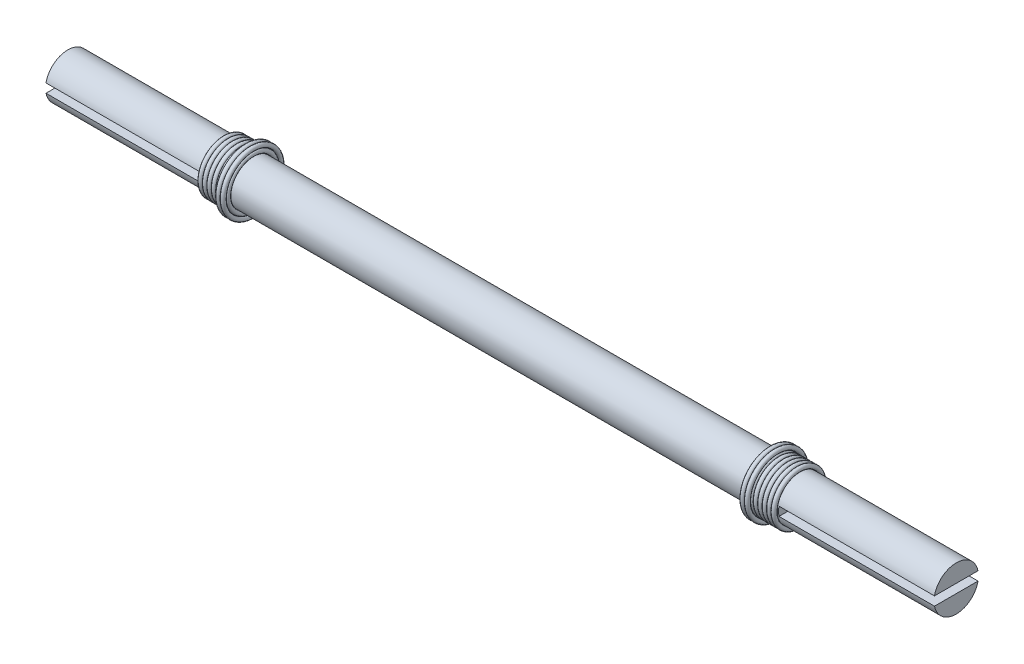
ISO-10303-21;
HEADER;
FILE_DESCRIPTION(('STEP AP214'),'2;1');
FILE_NAME('part.step','',(''),(''),'','','');
FILE_SCHEMA(('AUTOMOTIVE_DESIGN { 1 0 10303 214 1 1 1 1 }'));
ENDSEC;
DATA;
#1=APPLICATION_CONTEXT('core data for automotive mechanical design processes');
#2=APPLICATION_PROTOCOL_DEFINITION('international standard','automotive_design',2000,#1);
#3=PRODUCT_CONTEXT('',#1,'mechanical');
#4=PRODUCT('Part','Part','',(#3));
#5=PRODUCT_RELATED_PRODUCT_CATEGORY('part','',(#4));
#6=PRODUCT_DEFINITION_FORMATION('','',#4);
#7=PRODUCT_DEFINITION_CONTEXT('part definition',#1,'design');
#8=PRODUCT_DEFINITION('design','',#6,#7);
#9=PRODUCT_DEFINITION_SHAPE('','',#8);
#10=(LENGTH_UNIT() NAMED_UNIT(*) SI_UNIT(.MILLI.,.METRE.));
#11=(NAMED_UNIT(*) PLANE_ANGLE_UNIT() SI_UNIT($,.RADIAN.));
#12=(NAMED_UNIT(*) SI_UNIT($,.STERADIAN.) SOLID_ANGLE_UNIT());
#13=UNCERTAINTY_MEASURE_WITH_UNIT(LENGTH_MEASURE(1.E-05),#10,'distance_accuracy_value','');
#14=(GEOMETRIC_REPRESENTATION_CONTEXT(3) GLOBAL_UNCERTAINTY_ASSIGNED_CONTEXT((#13)) GLOBAL_UNIT_ASSIGNED_CONTEXT((#10,
#11,#12)) REPRESENTATION_CONTEXT('',''));
#15=CARTESIAN_POINT('',(0.,0.,0.));
#16=DIRECTION('',(0.,0.,1.));
#17=DIRECTION('',(1.,0.,0.));
#18=AXIS2_PLACEMENT_3D('',#15,#16,#17);
#19=CARTESIAN_POINT('',(100.,0.,0.));
#20=DIRECTION('',(1.,0.,0.));
#21=DIRECTION('',(0.,0.,-1.));
#22=AXIS2_PLACEMENT_3D('',#19,#20,#21);
#23=PLANE('',#22);
#24=DIRECTION('',(0.,0.,1.));
#25=VECTOR('',#24,1.);
#26=CARTESIAN_POINT('',(100.,1.,0.));
#27=LINE('',#26,#25);
#28=CARTESIAN_POINT('',(100.,1.,-4.89897948556633));
#29=VERTEX_POINT('',#28);
#30=CARTESIAN_POINT('',(100.,1.,4.89897948556636));
#31=VERTEX_POINT('',#30);
#32=EDGE_CURVE('E183',#29,#31,#27,.T.);
#33=ORIENTED_EDGE('',*,*,#32,.F.);
#34=CARTESIAN_POINT('',(100.,0.,0.));
#35=DIRECTION('',(1.,0.,0.));
#36=DIRECTION('',(0.,0.,-1.));
#37=AXIS2_PLACEMENT_3D('',#34,#35,#36);
#38=CIRCLE('',#37,5.);
#39=EDGE_CURVE('E179',#29,#31,#38,.T.);
#40=ORIENTED_EDGE('',*,*,#39,.T.);
#41=EDGE_LOOP('',(#33,#40));
#42=FACE_BOUND('',#41,.T.);
#43=ADVANCED_FACE('F64',(#42),#23,.T.);
#44=CARTESIAN_POINT('',(100.,0.,0.));
#45=DIRECTION('',(-1.,0.,0.));
#46=DIRECTION('',(0.,0.,1.));
#47=AXIS2_PLACEMENT_3D('',#44,#45,#46);
#48=CYLINDRICAL_SURFACE('',#47,5.);
#49=ORIENTED_EDGE('',*,*,#39,.F.);
#50=DIRECTION('',(-1.,0.,0.));
#51=VECTOR('',#50,1.);
#52=CARTESIAN_POINT('',(100.,1.,-4.89897948556633));
#53=LINE('',#52,#51);
#54=CARTESIAN_POINT('',(65.,1.,-4.89897948556633));
#55=VERTEX_POINT('',#54);
#56=EDGE_CURVE('E175',#29,#55,#53,.T.);
#57=ORIENTED_EDGE('',*,*,#56,.T.);
#58=CARTESIAN_POINT('',(65.,0.,0.));
#59=DIRECTION('',(-1.,0.,0.));
#60=DIRECTION('',(0.,0.,1.));
#61=AXIS2_PLACEMENT_3D('',#58,#59,#60);
#62=CIRCLE('',#61,5.);
#63=CARTESIAN_POINT('',(65.,-1.,-4.89897948556636));
#64=VERTEX_POINT('',#63);
#65=EDGE_CURVE('E14',#55,#64,#62,.T.);
#66=ORIENTED_EDGE('',*,*,#65,.T.);
#67=DIRECTION('',(-1.,0.,0.));
#68=VECTOR('',#67,1.);
#69=CARTESIAN_POINT('',(100.,-1.,-4.89897948556636));
#70=LINE('',#69,#68);
#71=CARTESIAN_POINT('',(100.,-1.,-4.89897948556636));
#72=VERTEX_POINT('',#71);
#73=EDGE_CURVE('E170',#64,#72,#70,.F.);
#74=ORIENTED_EDGE('',*,*,#73,.T.);
#75=CARTESIAN_POINT('',(100.,-1.,4.89897948556636));
#76=VERTEX_POINT('',#75);
#77=EDGE_CURVE('E178',#76,#72,#38,.T.);
#78=ORIENTED_EDGE('',*,*,#77,.F.);
#79=DIRECTION('',(-1.,0.,0.));
#80=VECTOR('',#79,1.);
#81=CARTESIAN_POINT('',(100.,-1.,4.89897948556636));
#82=LINE('',#81,#80);
#83=CARTESIAN_POINT('',(65.,-1.,4.89897948556636));
#84=VERTEX_POINT('',#83);
#85=EDGE_CURVE('E79',#76,#84,#82,.T.);
#86=ORIENTED_EDGE('',*,*,#85,.T.);
#87=CARTESIAN_POINT('',(65.,1.,4.89897948556636));
#88=VERTEX_POINT('',#87);
#89=EDGE_CURVE('E68',#84,#88,#62,.T.);
#90=ORIENTED_EDGE('',*,*,#89,.T.);
#91=DIRECTION('',(-1.,0.,0.));
#92=VECTOR('',#91,1.);
#93=CARTESIAN_POINT('',(100.,1.,4.89897948556636));
#94=LINE('',#93,#92);
#95=EDGE_CURVE('E87',#88,#31,#94,.F.);
#96=ORIENTED_EDGE('',*,*,#95,.T.);
#97=EDGE_LOOP('',(#49,#57,#66,#74,#78,#86,#90,#96));
#98=FACE_BOUND('',#97,.T.);
#99=CARTESIAN_POINT('',(-100.,0.,0.));
#100=DIRECTION('',(1.,0.,0.));
#101=DIRECTION('',(0.,0.,-1.));
#102=AXIS2_PLACEMENT_3D('',#99,#100,#101);
#103=CIRCLE('',#102,5.);
#104=CARTESIAN_POINT('',(-100.,1.,-4.89897948556633));
#105=VERTEX_POINT('',#104);
#106=CARTESIAN_POINT('',(-100.,1.,4.89897948556636));
#107=VERTEX_POINT('',#106);
#108=EDGE_CURVE('E139',#105,#107,#103,.T.);
#109=ORIENTED_EDGE('',*,*,#108,.T.);
#110=DIRECTION('',(1.,0.,0.));
#111=VECTOR('',#110,1.);
#112=CARTESIAN_POINT('',(-100.,1.,4.89897948556636));
#113=LINE('',#112,#111);
#114=CARTESIAN_POINT('',(-65.,1.,4.89897948556636));
#115=VERTEX_POINT('',#114);
#116=EDGE_CURVE('E155',#115,#107,#113,.F.);
#117=ORIENTED_EDGE('',*,*,#116,.F.);
#118=CARTESIAN_POINT('',(-65.,0.,0.));
#119=DIRECTION('',(-1.,0.,0.));
#120=DIRECTION('',(0.,0.,1.));
#121=AXIS2_PLACEMENT_3D('',#118,#119,#120);
#122=CIRCLE('',#121,5.);
#123=CARTESIAN_POINT('',(-65.,-1.,4.89897948556636));
#124=VERTEX_POINT('',#123);
#125=EDGE_CURVE('E161',#124,#115,#122,.T.);
#126=ORIENTED_EDGE('',*,*,#125,.F.);
#127=DIRECTION('',(1.,0.,0.));
#128=VECTOR('',#127,1.);
#129=CARTESIAN_POINT('',(-100.,-1.,4.89897948556636));
#130=LINE('',#129,#128);
#131=CARTESIAN_POINT('',(-100.,-1.,4.89897948556636));
#132=VERTEX_POINT('',#131);
#133=EDGE_CURVE('E148',#132,#124,#130,.T.);
#134=ORIENTED_EDGE('',*,*,#133,.F.);
#135=CARTESIAN_POINT('',(-100.,-1.,-4.89897948556636));
#136=VERTEX_POINT('',#135);
#137=EDGE_CURVE('E134',#132,#136,#103,.T.);
#138=ORIENTED_EDGE('',*,*,#137,.T.);
#139=DIRECTION('',(1.,0.,0.));
#140=VECTOR('',#139,1.);
#141=CARTESIAN_POINT('',(-100.,-1.,-4.89897948556636));
#142=LINE('',#141,#140);
#143=CARTESIAN_POINT('',(-65.,-1.,-4.89897948556636));
#144=VERTEX_POINT('',#143);
#145=EDGE_CURVE('E142',#144,#136,#142,.F.);
#146=ORIENTED_EDGE('',*,*,#145,.F.);
#147=CARTESIAN_POINT('',(-65.,1.,-4.89897948556633));
#148=VERTEX_POINT('',#147);
#149=EDGE_CURVE('E164',#148,#144,#122,.T.);
#150=ORIENTED_EDGE('',*,*,#149,.F.);
#151=DIRECTION('',(1.,0.,0.));
#152=VECTOR('',#151,1.);
#153=CARTESIAN_POINT('',(-100.,1.,-4.89897948556633));
#154=LINE('',#153,#152);
#155=EDGE_CURVE('E152',#105,#148,#154,.T.);
#156=ORIENTED_EDGE('',*,*,#155,.F.);
#157=EDGE_LOOP('',(#109,#117,#126,#134,#138,#146,#150,#156));
#158=FACE_BOUND('',#157,.T.);
#159=ADVANCED_FACE('F66',(#98,#158),#48,.T.);
#160=DIRECTION('',(0.,0.,-1.));
#161=VECTOR('',#160,1.);
#162=CARTESIAN_POINT('',(100.,-1.,0.));
#163=LINE('',#162,#161);
#164=EDGE_CURVE('E182',#76,#72,#163,.T.);
#165=ORIENTED_EDGE('',*,*,#164,.F.);
#166=ORIENTED_EDGE('',*,*,#77,.T.);
#167=EDGE_LOOP('',(#165,#166));
#168=FACE_BOUND('',#167,.T.);
#169=ADVANCED_FACE('F194',(#168),#23,.T.);
#170=CARTESIAN_POINT('',(65.,0.,0.));
#171=DIRECTION('',(-1.,0.,0.));
#172=DIRECTION('',(0.,0.,1.));
#173=AXIS2_PLACEMENT_3D('',#170,#171,#172);
#174=PLANE('',#173);
#175=DIRECTION('',(0.,0.,1.));
#176=VECTOR('',#175,1.);
#177=CARTESIAN_POINT('',(65.,1.,6.45567951505827));
#178=LINE('',#177,#176);
#179=EDGE_CURVE('E165',#55,#88,#178,.T.);
#180=ORIENTED_EDGE('',*,*,#179,.T.);
#181=ORIENTED_EDGE('',*,*,#89,.F.);
#182=DIRECTION('',(0.,0.,-1.));
#183=VECTOR('',#182,1.);
#184=CARTESIAN_POINT('',(65.,-1.,-7.22510667641652));
#185=LINE('',#184,#183);
#186=EDGE_CURVE('E167',#84,#64,#185,.T.);
#187=ORIENTED_EDGE('',*,*,#186,.T.);
#188=ORIENTED_EDGE('',*,*,#65,.F.);
#189=EDGE_LOOP('',(#180,#181,#187,#188));
#190=FACE_BOUND('',#189,.T.);
#191=ADVANCED_FACE('F190',(#190),#174,.F.);
#192=CARTESIAN_POINT('',(65.,1.,0.));
#193=DIRECTION('',(0.,1.,0.));
#194=DIRECTION('',(0.,0.,1.));
#195=AXIS2_PLACEMENT_3D('',#192,#193,#194);
#196=PLANE('',#195);
#197=ORIENTED_EDGE('',*,*,#32,.T.);
#198=ORIENTED_EDGE('',*,*,#95,.F.);
#199=ORIENTED_EDGE('',*,*,#179,.F.);
#200=ORIENTED_EDGE('',*,*,#56,.F.);
#201=EDGE_LOOP('',(#197,#198,#199,#200));
#202=FACE_BOUND('',#201,.T.);
#203=ADVANCED_FACE('F200',(#202),#196,.F.);
#204=CARTESIAN_POINT('',(65.,-1.,-7.22510667641652));
#205=DIRECTION('',(0.,-1.,0.));
#206=DIRECTION('',(0.,0.,-1.));
#207=AXIS2_PLACEMENT_3D('',#204,#205,#206);
#208=PLANE('',#207);
#209=ORIENTED_EDGE('',*,*,#164,.T.);
#210=ORIENTED_EDGE('',*,*,#73,.F.);
#211=ORIENTED_EDGE('',*,*,#186,.F.);
#212=ORIENTED_EDGE('',*,*,#85,.F.);
#213=EDGE_LOOP('',(#209,#210,#211,#212));
#214=FACE_BOUND('',#213,.T.);
#215=ADVANCED_FACE('F191',(#214),#208,.F.);
#216=CARTESIAN_POINT('',(-100.,0.,0.));
#217=DIRECTION('',(-1.,0.,0.));
#218=DIRECTION('',(0.,0.,-1.));
#219=AXIS2_PLACEMENT_3D('',#216,#217,#218);
#220=PLANE('',#219);
#221=DIRECTION('',(0.,0.,1.));
#222=VECTOR('',#221,1.);
#223=CARTESIAN_POINT('',(-100.,1.,0.));
#224=LINE('',#223,#222);
#225=EDGE_CURVE('E138',#105,#107,#224,.T.);
#226=ORIENTED_EDGE('',*,*,#225,.T.);
#227=ORIENTED_EDGE('',*,*,#108,.F.);
#228=EDGE_LOOP('',(#226,#227));
#229=FACE_BOUND('',#228,.T.);
#230=ADVANCED_FACE('F212',(#229),#220,.T.);
#231=DIRECTION('',(0.,0.,-1.));
#232=VECTOR('',#231,1.);
#233=CARTESIAN_POINT('',(-100.,-1.,0.));
#234=LINE('',#233,#232);
#235=EDGE_CURVE('E130',#132,#136,#234,.T.);
#236=ORIENTED_EDGE('',*,*,#235,.T.);
#237=ORIENTED_EDGE('',*,*,#137,.F.);
#238=EDGE_LOOP('',(#236,#237));
#239=FACE_BOUND('',#238,.T.);
#240=ADVANCED_FACE('F132',(#239),#220,.T.);
#241=CARTESIAN_POINT('',(-65.,0.,0.));
#242=DIRECTION('',(1.,0.,0.));
#243=DIRECTION('',(0.,0.,1.));
#244=AXIS2_PLACEMENT_3D('',#241,#242,#243);
#245=PLANE('',#244);
#246=DIRECTION('',(0.,0.,1.));
#247=VECTOR('',#246,1.);
#248=CARTESIAN_POINT('',(-65.,1.,6.45567951505827));
#249=LINE('',#248,#247);
#250=EDGE_CURVE('E227',#148,#115,#249,.T.);
#251=ORIENTED_EDGE('',*,*,#250,.F.);
#252=ORIENTED_EDGE('',*,*,#149,.T.);
#253=DIRECTION('',(0.,0.,-1.));
#254=VECTOR('',#253,1.);
#255=CARTESIAN_POINT('',(-65.,-1.,-7.22510667641652));
#256=LINE('',#255,#254);
#257=EDGE_CURVE('E144',#124,#144,#256,.T.);
#258=ORIENTED_EDGE('',*,*,#257,.F.);
#259=ORIENTED_EDGE('',*,*,#125,.T.);
#260=EDGE_LOOP('',(#251,#252,#258,#259));
#261=FACE_BOUND('',#260,.T.);
#262=ADVANCED_FACE('F216',(#261),#245,.F.);
#263=CARTESIAN_POINT('',(-65.,1.,0.));
#264=DIRECTION('',(0.,1.,0.));
#265=DIRECTION('',(0.,0.,1.));
#266=AXIS2_PLACEMENT_3D('',#263,#264,#265);
#267=PLANE('',#266);
#268=ORIENTED_EDGE('',*,*,#225,.F.);
#269=ORIENTED_EDGE('',*,*,#155,.T.);
#270=ORIENTED_EDGE('',*,*,#250,.T.);
#271=ORIENTED_EDGE('',*,*,#116,.T.);
#272=EDGE_LOOP('',(#268,#269,#270,#271));
#273=FACE_BOUND('',#272,.T.);
#274=ADVANCED_FACE('F219',(#273),#267,.F.);
#275=CARTESIAN_POINT('',(-65.,-1.,-7.22510667641652));
#276=DIRECTION('',(0.,-1.,0.));
#277=DIRECTION('',(0.,0.,-1.));
#278=AXIS2_PLACEMENT_3D('',#275,#276,#277);
#279=PLANE('',#278);
#280=ORIENTED_EDGE('',*,*,#235,.F.);
#281=ORIENTED_EDGE('',*,*,#133,.T.);
#282=ORIENTED_EDGE('',*,*,#257,.T.);
#283=ORIENTED_EDGE('',*,*,#145,.T.);
#284=EDGE_LOOP('',(#280,#281,#282,#283));
#285=FACE_BOUND('',#284,.T.);
#286=ADVANCED_FACE('F143',(#285),#279,.F.);
#287=CLOSED_SHELL('',(#43,#159,#169,#191,#203,#215,#230,#240,#262,#274,#286));
#288=MANIFOLD_SOLID_BREP('B2',#287);
#289=CARTESIAN_POINT('',(-58.5,0.,0.));
#290=DIRECTION('',(-1.,0.,0.));
#291=DIRECTION('',(0.,0.,-1.));
#292=AXIS2_PLACEMENT_3D('',#289,#290,#291);
#293=TOROIDAL_SURFACE('',#292,5.5,0.499999999999999);
#294=CARTESIAN_POINT('',(-58.5,5.50000000000001,0.));
#295=DIRECTION('',(0.,0.,-1.));
#296=DIRECTION('',(-1.,0.,0.));
#297=AXIS2_PLACEMENT_3D('',#294,#295,#296);
#298=CIRCLE('',#297,0.499999999999999);
#299=CARTESIAN_POINT('',(-58.5,6.,0.));
#300=VERTEX_POINT('',#299);
#301=EDGE_CURVE('E63',#300,#300,#298,.T.);
#302=CARTESIAN_POINT('',(-58.5,0.,0.));
#303=DIRECTION('',(-1.,0.,0.));
#304=DIRECTION('',(0.,0.,-1.));
#305=AXIS2_PLACEMENT_3D('',#302,#303,#304);
#306=CIRCLE('',#305,6.);
#307=EDGE_CURVE('',#300,#300,#306,.T.);
#308=ORIENTED_EDGE('',*,*,#301,.T.);
#309=ORIENTED_EDGE('',*,*,#301,.F.);
#310=ORIENTED_EDGE('',*,*,#307,.T.);
#311=ORIENTED_EDGE('',*,*,#307,.F.);
#312=EDGE_LOOP('',(#308,#310,#309,#311));
#313=FACE_BOUND('',#312,.T.);
#314=ADVANCED_FACE('F299',(#313),#293,.T.);
#315=OPEN_SHELL('',(#314));
#316=SHELL_BASED_SURFACE_MODEL('B8',(#315));
#317=CARTESIAN_POINT('',(-59.5,0.,0.));
#318=DIRECTION('',(-1.,0.,0.));
#319=DIRECTION('',(0.,0.,-1.));
#320=AXIS2_PLACEMENT_3D('',#317,#318,#319);
#321=TOROIDAL_SURFACE('',#320,6.5,0.499999999999999);
#322=CARTESIAN_POINT('',(-59.5,6.50000000000001,0.));
#323=DIRECTION('',(0.,0.,-1.));
#324=DIRECTION('',(-1.,0.,0.));
#325=AXIS2_PLACEMENT_3D('',#322,#323,#324);
#326=CIRCLE('',#325,0.499999999999999);
#327=CARTESIAN_POINT('',(-59.5,7.,0.));
#328=VERTEX_POINT('',#327);
#329=EDGE_CURVE('E298',#328,#328,#326,.T.);
#330=CARTESIAN_POINT('',(-59.5,0.,0.));
#331=DIRECTION('',(-1.,0.,0.));
#332=DIRECTION('',(0.,0.,-1.));
#333=AXIS2_PLACEMENT_3D('',#330,#331,#332);
#334=CIRCLE('',#333,7.);
#335=EDGE_CURVE('',#328,#328,#334,.T.);
#336=ORIENTED_EDGE('',*,*,#329,.T.);
#337=ORIENTED_EDGE('',*,*,#329,.F.);
#338=ORIENTED_EDGE('',*,*,#335,.T.);
#339=ORIENTED_EDGE('',*,*,#335,.F.);
#340=EDGE_LOOP('',(#336,#338,#337,#339));
#341=FACE_BOUND('',#340,.T.);
#342=ADVANCED_FACE('F330',(#341),#321,.T.);
#343=OPEN_SHELL('',(#342));
#344=SHELL_BASED_SURFACE_MODEL('B58',(#343));
#345=CARTESIAN_POINT('',(-58.5,0.,0.));
#346=DIRECTION('',(-1.,0.,0.));
#347=DIRECTION('',(0.,0.,-1.));
#348=AXIS2_PLACEMENT_3D('',#345,#346,#347);
#349=TOROIDAL_SURFACE('',#348,6.5,0.499999999999999);
#350=CARTESIAN_POINT('',(-58.5,6.50000000000001,0.));
#351=DIRECTION('',(0.,0.,-1.));
#352=DIRECTION('',(-1.,0.,0.));
#353=AXIS2_PLACEMENT_3D('',#350,#351,#352);
#354=CIRCLE('',#353,0.499999999999999);
#355=CARTESIAN_POINT('',(-58.5,7.,0.));
#356=VERTEX_POINT('',#355);
#357=EDGE_CURVE('E329',#356,#356,#354,.T.);
#358=CARTESIAN_POINT('',(-58.5,0.,0.));
#359=DIRECTION('',(-1.,0.,0.));
#360=DIRECTION('',(0.,0.,-1.));
#361=AXIS2_PLACEMENT_3D('',#358,#359,#360);
#362=CIRCLE('',#361,7.);
#363=EDGE_CURVE('',#356,#356,#362,.T.);
#364=ORIENTED_EDGE('',*,*,#357,.T.);
#365=ORIENTED_EDGE('',*,*,#357,.F.);
#366=ORIENTED_EDGE('',*,*,#363,.T.);
#367=ORIENTED_EDGE('',*,*,#363,.F.);
#368=EDGE_LOOP('',(#364,#366,#365,#367));
#369=FACE_BOUND('',#368,.T.);
#370=ADVANCED_FACE('F360',(#369),#349,.T.);
#371=OPEN_SHELL('',(#370));
#372=SHELL_BASED_SURFACE_MODEL('B293',(#371));
#373=CARTESIAN_POINT('',(-59.5,0.,0.));
#374=DIRECTION('',(-1.,0.,0.));
#375=DIRECTION('',(0.,0.,-1.));
#376=AXIS2_PLACEMENT_3D('',#373,#374,#375);
#377=TOROIDAL_SURFACE('',#376,5.5,0.499999999999999);
#378=CARTESIAN_POINT('',(-59.5,5.50000000000001,0.));
#379=DIRECTION('',(0.,0.,-1.));
#380=DIRECTION('',(-1.,0.,0.));
#381=AXIS2_PLACEMENT_3D('',#378,#379,#380);
#382=CIRCLE('',#381,0.499999999999999);
#383=CARTESIAN_POINT('',(-59.5,6.,0.));
#384=VERTEX_POINT('',#383);
#385=EDGE_CURVE('E359',#384,#384,#382,.T.);
#386=CARTESIAN_POINT('',(-59.5,0.,0.));
#387=DIRECTION('',(-1.,0.,0.));
#388=DIRECTION('',(0.,0.,-1.));
#389=AXIS2_PLACEMENT_3D('',#386,#387,#388);
#390=CIRCLE('',#389,6.);
#391=EDGE_CURVE('',#384,#384,#390,.T.);
#392=ORIENTED_EDGE('',*,*,#385,.T.);
#393=ORIENTED_EDGE('',*,*,#385,.F.);
#394=ORIENTED_EDGE('',*,*,#391,.T.);
#395=ORIENTED_EDGE('',*,*,#391,.F.);
#396=EDGE_LOOP('',(#392,#394,#393,#395));
#397=FACE_BOUND('',#396,.T.);
#398=ADVANCED_FACE('F383',(#397),#377,.T.);
#399=OPEN_SHELL('',(#398));
#400=SHELL_BASED_SURFACE_MODEL('B324',(#399));
#401=CARTESIAN_POINT('',(-60.5,0.,0.));
#402=DIRECTION('',(-1.,0.,0.));
#403=DIRECTION('',(0.,0.,-1.));
#404=AXIS2_PLACEMENT_3D('',#401,#402,#403);
#405=TOROIDAL_SURFACE('',#404,5.5,0.499999999999999);
#406=CARTESIAN_POINT('',(-60.5,5.50000000000001,0.));
#407=DIRECTION('',(0.,0.,-1.));
#408=DIRECTION('',(-1.,0.,0.));
#409=AXIS2_PLACEMENT_3D('',#406,#407,#408);
#410=CIRCLE('',#409,0.499999999999999);
#411=CARTESIAN_POINT('',(-60.5,6.,0.));
#412=VERTEX_POINT('',#411);
#413=EDGE_CURVE('E382',#412,#412,#410,.T.);
#414=CARTESIAN_POINT('',(-60.5,0.,0.));
#415=DIRECTION('',(-1.,0.,0.));
#416=DIRECTION('',(0.,0.,-1.));
#417=AXIS2_PLACEMENT_3D('',#414,#415,#416);
#418=CIRCLE('',#417,6.);
#419=EDGE_CURVE('',#412,#412,#418,.T.);
#420=ORIENTED_EDGE('',*,*,#413,.T.);
#421=ORIENTED_EDGE('',*,*,#413,.F.);
#422=ORIENTED_EDGE('',*,*,#419,.T.);
#423=ORIENTED_EDGE('',*,*,#419,.F.);
#424=EDGE_LOOP('',(#420,#422,#421,#423));
#425=FACE_BOUND('',#424,.T.);
#426=ADVANCED_FACE('F407',(#425),#405,.T.);
#427=OPEN_SHELL('',(#426));
#428=SHELL_BASED_SURFACE_MODEL('B354',(#427));
#429=CARTESIAN_POINT('',(-61.5,0.,0.));
#430=DIRECTION('',(-1.,0.,0.));
#431=DIRECTION('',(0.,0.,-1.));
#432=AXIS2_PLACEMENT_3D('',#429,#430,#431);
#433=TOROIDAL_SURFACE('',#432,5.5,0.499999999999999);
#434=CARTESIAN_POINT('',(-61.5,5.50000000000001,0.));
#435=DIRECTION('',(0.,0.,-1.));
#436=DIRECTION('',(-1.,0.,0.));
#437=AXIS2_PLACEMENT_3D('',#434,#435,#436);
#438=CIRCLE('',#437,0.499999999999999);
#439=CARTESIAN_POINT('',(-61.5,6.,0.));
#440=VERTEX_POINT('',#439);
#441=EDGE_CURVE('E406',#440,#440,#438,.T.);
#442=CARTESIAN_POINT('',(-61.5,0.,0.));
#443=DIRECTION('',(-1.,0.,0.));
#444=DIRECTION('',(0.,0.,-1.));
#445=AXIS2_PLACEMENT_3D('',#442,#443,#444);
#446=CIRCLE('',#445,6.);
#447=EDGE_CURVE('',#440,#440,#446,.T.);
#448=ORIENTED_EDGE('',*,*,#441,.T.);
#449=ORIENTED_EDGE('',*,*,#441,.F.);
#450=ORIENTED_EDGE('',*,*,#447,.T.);
#451=ORIENTED_EDGE('',*,*,#447,.F.);
#452=EDGE_LOOP('',(#448,#450,#449,#451));
#453=FACE_BOUND('',#452,.T.);
#454=ADVANCED_FACE('F431',(#453),#433,.T.);
#455=OPEN_SHELL('',(#454));
#456=SHELL_BASED_SURFACE_MODEL('B377',(#455));
#457=CARTESIAN_POINT('',(-62.5,0.,0.));
#458=DIRECTION('',(-1.,0.,0.));
#459=DIRECTION('',(0.,0.,-1.));
#460=AXIS2_PLACEMENT_3D('',#457,#458,#459);
#461=TOROIDAL_SURFACE('',#460,5.5,0.499999999999999);
#462=CARTESIAN_POINT('',(-62.5,5.50000000000001,0.));
#463=DIRECTION('',(0.,0.,-1.));
#464=DIRECTION('',(-1.,0.,0.));
#465=AXIS2_PLACEMENT_3D('',#462,#463,#464);
#466=CIRCLE('',#465,0.499999999999999);
#467=CARTESIAN_POINT('',(-62.5,6.,0.));
#468=VERTEX_POINT('',#467);
#469=EDGE_CURVE('E430',#468,#468,#466,.T.);
#470=CARTESIAN_POINT('',(-62.5,0.,0.));
#471=DIRECTION('',(-1.,0.,0.));
#472=DIRECTION('',(0.,0.,-1.));
#473=AXIS2_PLACEMENT_3D('',#470,#471,#472);
#474=CIRCLE('',#473,6.);
#475=EDGE_CURVE('',#468,#468,#474,.T.);
#476=ORIENTED_EDGE('',*,*,#469,.T.);
#477=ORIENTED_EDGE('',*,*,#469,.F.);
#478=ORIENTED_EDGE('',*,*,#475,.T.);
#479=ORIENTED_EDGE('',*,*,#475,.F.);
#480=EDGE_LOOP('',(#476,#478,#477,#479));
#481=FACE_BOUND('',#480,.T.);
#482=ADVANCED_FACE('F455',(#481),#461,.T.);
#483=OPEN_SHELL('',(#482));
#484=SHELL_BASED_SURFACE_MODEL('B401',(#483));
#485=CARTESIAN_POINT('',(-63.5,0.,0.));
#486=DIRECTION('',(-1.,0.,0.));
#487=DIRECTION('',(0.,0.,-1.));
#488=AXIS2_PLACEMENT_3D('',#485,#486,#487);
#489=TOROIDAL_SURFACE('',#488,5.5,0.499999999999999);
#490=CARTESIAN_POINT('',(-63.5,5.50000000000001,0.));
#491=DIRECTION('',(0.,0.,-1.));
#492=DIRECTION('',(-1.,0.,0.));
#493=AXIS2_PLACEMENT_3D('',#490,#491,#492);
#494=CIRCLE('',#493,0.499999999999999);
#495=CARTESIAN_POINT('',(-63.5,6.,0.));
#496=VERTEX_POINT('',#495);
#497=EDGE_CURVE('E454',#496,#496,#494,.T.);
#498=CARTESIAN_POINT('',(-63.5,0.,0.));
#499=DIRECTION('',(-1.,0.,0.));
#500=DIRECTION('',(0.,0.,-1.));
#501=AXIS2_PLACEMENT_3D('',#498,#499,#500);
#502=CIRCLE('',#501,6.);
#503=EDGE_CURVE('',#496,#496,#502,.T.);
#504=ORIENTED_EDGE('',*,*,#497,.T.);
#505=ORIENTED_EDGE('',*,*,#497,.F.);
#506=ORIENTED_EDGE('',*,*,#503,.T.);
#507=ORIENTED_EDGE('',*,*,#503,.F.);
#508=EDGE_LOOP('',(#504,#506,#505,#507));
#509=FACE_BOUND('',#508,.T.);
#510=ADVANCED_FACE('F479',(#509),#489,.T.);
#511=OPEN_SHELL('',(#510));
#512=SHELL_BASED_SURFACE_MODEL('B425',(#511));
#513=CARTESIAN_POINT('',(-64.5,0.,0.));
#514=DIRECTION('',(-1.,0.,0.));
#515=DIRECTION('',(0.,0.,-1.));
#516=AXIS2_PLACEMENT_3D('',#513,#514,#515);
#517=TOROIDAL_SURFACE('',#516,5.5,0.499999999999999);
#518=CARTESIAN_POINT('',(-64.5,5.50000000000001,0.));
#519=DIRECTION('',(0.,0.,-1.));
#520=DIRECTION('',(-1.,0.,0.));
#521=AXIS2_PLACEMENT_3D('',#518,#519,#520);
#522=CIRCLE('',#521,0.499999999999999);
#523=CARTESIAN_POINT('',(-64.5,6.,0.));
#524=VERTEX_POINT('',#523);
#525=EDGE_CURVE('E478',#524,#524,#522,.T.);
#526=CARTESIAN_POINT('',(-64.5,0.,0.));
#527=DIRECTION('',(-1.,0.,0.));
#528=DIRECTION('',(0.,0.,-1.));
#529=AXIS2_PLACEMENT_3D('',#526,#527,#528);
#530=CIRCLE('',#529,6.);
#531=EDGE_CURVE('',#524,#524,#530,.T.);
#532=ORIENTED_EDGE('',*,*,#525,.T.);
#533=ORIENTED_EDGE('',*,*,#525,.F.);
#534=ORIENTED_EDGE('',*,*,#531,.T.);
#535=ORIENTED_EDGE('',*,*,#531,.F.);
#536=EDGE_LOOP('',(#532,#534,#533,#535));
#537=FACE_BOUND('',#536,.T.);
#538=ADVANCED_FACE('F505',(#537),#517,.T.);
#539=OPEN_SHELL('',(#538));
#540=SHELL_BASED_SURFACE_MODEL('B449',(#539));
#541=CARTESIAN_POINT('',(59.5,0.,0.));
#542=DIRECTION('',(1.,0.,0.));
#543=DIRECTION('',(0.,0.,-1.));
#544=AXIS2_PLACEMENT_3D('',#541,#542,#543);
#545=TOROIDAL_SURFACE('',#544,6.5,0.499999999999999);
#546=CARTESIAN_POINT('',(59.5,6.50000000000001,0.));
#547=DIRECTION('',(0.,0.,1.));
#548=DIRECTION('',(1.,0.,0.));
#549=AXIS2_PLACEMENT_3D('',#546,#547,#548);
#550=CIRCLE('',#549,0.499999999999999);
#551=CARTESIAN_POINT('',(59.5,7.,0.));
#552=VERTEX_POINT('',#551);
#553=EDGE_CURVE('E504',#552,#552,#550,.T.);
#554=CARTESIAN_POINT('',(59.5,0.,0.));
#555=DIRECTION('',(1.,0.,0.));
#556=DIRECTION('',(0.,0.,-1.));
#557=AXIS2_PLACEMENT_3D('',#554,#555,#556);
#558=CIRCLE('',#557,7.);
#559=EDGE_CURVE('',#552,#552,#558,.T.);
#560=ORIENTED_EDGE('',*,*,#553,.T.);
#561=ORIENTED_EDGE('',*,*,#553,.F.);
#562=ORIENTED_EDGE('',*,*,#559,.T.);
#563=ORIENTED_EDGE('',*,*,#559,.F.);
#564=EDGE_LOOP('',(#560,#562,#561,#563));
#565=FACE_BOUND('',#564,.T.);
#566=ADVANCED_FACE('F537',(#565),#545,.T.);
#567=OPEN_SHELL('',(#566));
#568=SHELL_BASED_SURFACE_MODEL('B473',(#567));
#569=CARTESIAN_POINT('',(58.5,0.,0.));
#570=DIRECTION('',(1.,0.,0.));
#571=DIRECTION('',(0.,0.,-1.));
#572=AXIS2_PLACEMENT_3D('',#569,#570,#571);
#573=TOROIDAL_SURFACE('',#572,6.5,0.499999999999999);
#574=CARTESIAN_POINT('',(58.5,6.50000000000001,0.));
#575=DIRECTION('',(0.,0.,1.));
#576=DIRECTION('',(1.,0.,0.));
#577=AXIS2_PLACEMENT_3D('',#574,#575,#576);
#578=CIRCLE('',#577,0.499999999999999);
#579=CARTESIAN_POINT('',(58.5,7.,0.));
#580=VERTEX_POINT('',#579);
#581=EDGE_CURVE('E536',#580,#580,#578,.T.);
#582=CARTESIAN_POINT('',(58.5,0.,0.));
#583=DIRECTION('',(1.,0.,0.));
#584=DIRECTION('',(0.,0.,-1.));
#585=AXIS2_PLACEMENT_3D('',#582,#583,#584);
#586=CIRCLE('',#585,7.);
#587=EDGE_CURVE('',#580,#580,#586,.T.);
#588=ORIENTED_EDGE('',*,*,#581,.T.);
#589=ORIENTED_EDGE('',*,*,#581,.F.);
#590=ORIENTED_EDGE('',*,*,#587,.T.);
#591=ORIENTED_EDGE('',*,*,#587,.F.);
#592=EDGE_LOOP('',(#588,#590,#589,#591));
#593=FACE_BOUND('',#592,.T.);
#594=ADVANCED_FACE('F566',(#593),#573,.T.);
#595=OPEN_SHELL('',(#594));
#596=SHELL_BASED_SURFACE_MODEL('B499',(#595));
#597=CARTESIAN_POINT('',(64.5,0.,0.));
#598=DIRECTION('',(1.,0.,0.));
#599=DIRECTION('',(0.,0.,-1.));
#600=AXIS2_PLACEMENT_3D('',#597,#598,#599);
#601=TOROIDAL_SURFACE('',#600,5.5,0.499999999999999);
#602=CARTESIAN_POINT('',(64.5,5.50000000000001,0.));
#603=DIRECTION('',(0.,0.,1.));
#604=DIRECTION('',(1.,0.,0.));
#605=AXIS2_PLACEMENT_3D('',#602,#603,#604);
#606=CIRCLE('',#605,0.499999999999999);
#607=CARTESIAN_POINT('',(64.5,6.,0.));
#608=VERTEX_POINT('',#607);
#609=EDGE_CURVE('E565',#608,#608,#606,.T.);
#610=CARTESIAN_POINT('',(64.5,0.,0.));
#611=DIRECTION('',(1.,0.,0.));
#612=DIRECTION('',(0.,0.,-1.));
#613=AXIS2_PLACEMENT_3D('',#610,#611,#612);
#614=CIRCLE('',#613,6.);
#615=EDGE_CURVE('',#608,#608,#614,.T.);
#616=ORIENTED_EDGE('',*,*,#609,.T.);
#617=ORIENTED_EDGE('',*,*,#609,.F.);
#618=ORIENTED_EDGE('',*,*,#615,.T.);
#619=ORIENTED_EDGE('',*,*,#615,.F.);
#620=EDGE_LOOP('',(#616,#618,#617,#619));
#621=FACE_BOUND('',#620,.T.);
#622=ADVANCED_FACE('F590',(#621),#601,.T.);
#623=OPEN_SHELL('',(#622));
#624=SHELL_BASED_SURFACE_MODEL('B531',(#623));
#625=CARTESIAN_POINT('',(63.5,0.,0.));
#626=DIRECTION('',(1.,0.,0.));
#627=DIRECTION('',(0.,0.,-1.));
#628=AXIS2_PLACEMENT_3D('',#625,#626,#627);
#629=TOROIDAL_SURFACE('',#628,5.5,0.499999999999999);
#630=CARTESIAN_POINT('',(63.5,5.50000000000001,0.));
#631=DIRECTION('',(0.,0.,1.));
#632=DIRECTION('',(1.,0.,0.));
#633=AXIS2_PLACEMENT_3D('',#630,#631,#632);
#634=CIRCLE('',#633,0.499999999999999);
#635=CARTESIAN_POINT('',(63.5,6.,0.));
#636=VERTEX_POINT('',#635);
#637=EDGE_CURVE('E589',#636,#636,#634,.T.);
#638=CARTESIAN_POINT('',(63.5,0.,0.));
#639=DIRECTION('',(1.,0.,0.));
#640=DIRECTION('',(0.,0.,-1.));
#641=AXIS2_PLACEMENT_3D('',#638,#639,#640);
#642=CIRCLE('',#641,6.);
#643=EDGE_CURVE('',#636,#636,#642,.T.);
#644=ORIENTED_EDGE('',*,*,#637,.T.);
#645=ORIENTED_EDGE('',*,*,#637,.F.);
#646=ORIENTED_EDGE('',*,*,#643,.T.);
#647=ORIENTED_EDGE('',*,*,#643,.F.);
#648=EDGE_LOOP('',(#644,#646,#645,#647));
#649=FACE_BOUND('',#648,.T.);
#650=ADVANCED_FACE('F619',(#649),#629,.T.);
#651=OPEN_SHELL('',(#650));
#652=SHELL_BASED_SURFACE_MODEL('B560',(#651));
#653=CARTESIAN_POINT('',(62.5,0.,0.));
#654=DIRECTION('',(1.,0.,0.));
#655=DIRECTION('',(0.,0.,-1.));
#656=AXIS2_PLACEMENT_3D('',#653,#654,#655);
#657=TOROIDAL_SURFACE('',#656,5.5,0.499999999999999);
#658=CARTESIAN_POINT('',(62.5,5.50000000000001,0.));
#659=DIRECTION('',(0.,0.,1.));
#660=DIRECTION('',(1.,0.,0.));
#661=AXIS2_PLACEMENT_3D('',#658,#659,#660);
#662=CIRCLE('',#661,0.499999999999999);
#663=CARTESIAN_POINT('',(62.5,6.,0.));
#664=VERTEX_POINT('',#663);
#665=EDGE_CURVE('E618',#664,#664,#662,.T.);
#666=CARTESIAN_POINT('',(62.5,0.,0.));
#667=DIRECTION('',(1.,0.,0.));
#668=DIRECTION('',(0.,0.,-1.));
#669=AXIS2_PLACEMENT_3D('',#666,#667,#668);
#670=CIRCLE('',#669,6.);
#671=EDGE_CURVE('',#664,#664,#670,.T.);
#672=ORIENTED_EDGE('',*,*,#665,.T.);
#673=ORIENTED_EDGE('',*,*,#665,.F.);
#674=ORIENTED_EDGE('',*,*,#671,.T.);
#675=ORIENTED_EDGE('',*,*,#671,.F.);
#676=EDGE_LOOP('',(#672,#674,#673,#675));
#677=FACE_BOUND('',#676,.T.);
#678=ADVANCED_FACE('F642',(#677),#657,.T.);
#679=OPEN_SHELL('',(#678));
#680=SHELL_BASED_SURFACE_MODEL('B584',(#679));
#681=CARTESIAN_POINT('',(61.5,0.,0.));
#682=DIRECTION('',(1.,0.,0.));
#683=DIRECTION('',(0.,0.,-1.));
#684=AXIS2_PLACEMENT_3D('',#681,#682,#683);
#685=TOROIDAL_SURFACE('',#684,5.5,0.499999999999999);
#686=CARTESIAN_POINT('',(61.5,5.50000000000001,0.));
#687=DIRECTION('',(0.,0.,1.));
#688=DIRECTION('',(1.,0.,0.));
#689=AXIS2_PLACEMENT_3D('',#686,#687,#688);
#690=CIRCLE('',#689,0.499999999999999);
#691=CARTESIAN_POINT('',(61.5,6.,0.));
#692=VERTEX_POINT('',#691);
#693=EDGE_CURVE('E641',#692,#692,#690,.T.);
#694=CARTESIAN_POINT('',(61.5,0.,0.));
#695=DIRECTION('',(1.,0.,0.));
#696=DIRECTION('',(0.,0.,-1.));
#697=AXIS2_PLACEMENT_3D('',#694,#695,#696);
#698=CIRCLE('',#697,6.);
#699=EDGE_CURVE('',#692,#692,#698,.T.);
#700=ORIENTED_EDGE('',*,*,#693,.T.);
#701=ORIENTED_EDGE('',*,*,#693,.F.);
#702=ORIENTED_EDGE('',*,*,#699,.T.);
#703=ORIENTED_EDGE('',*,*,#699,.F.);
#704=EDGE_LOOP('',(#700,#702,#701,#703));
#705=FACE_BOUND('',#704,.T.);
#706=ADVANCED_FACE('F665',(#705),#685,.T.);
#707=OPEN_SHELL('',(#706));
#708=SHELL_BASED_SURFACE_MODEL('B613',(#707));
#709=CARTESIAN_POINT('',(60.5,0.,0.));
#710=DIRECTION('',(1.,0.,0.));
#711=DIRECTION('',(0.,0.,-1.));
#712=AXIS2_PLACEMENT_3D('',#709,#710,#711);
#713=TOROIDAL_SURFACE('',#712,5.5,0.499999999999999);
#714=CARTESIAN_POINT('',(60.5,5.50000000000001,0.));
#715=DIRECTION('',(0.,0.,1.));
#716=DIRECTION('',(1.,0.,0.));
#717=AXIS2_PLACEMENT_3D('',#714,#715,#716);
#718=CIRCLE('',#717,0.499999999999999);
#719=CARTESIAN_POINT('',(60.5,6.,0.));
#720=VERTEX_POINT('',#719);
#721=EDGE_CURVE('E664',#720,#720,#718,.T.);
#722=CARTESIAN_POINT('',(60.5,0.,0.));
#723=DIRECTION('',(1.,0.,0.));
#724=DIRECTION('',(0.,0.,-1.));
#725=AXIS2_PLACEMENT_3D('',#722,#723,#724);
#726=CIRCLE('',#725,6.);
#727=EDGE_CURVE('',#720,#720,#726,.T.);
#728=ORIENTED_EDGE('',*,*,#721,.T.);
#729=ORIENTED_EDGE('',*,*,#721,.F.);
#730=ORIENTED_EDGE('',*,*,#727,.T.);
#731=ORIENTED_EDGE('',*,*,#727,.F.);
#732=EDGE_LOOP('',(#728,#730,#729,#731));
#733=FACE_BOUND('',#732,.T.);
#734=ADVANCED_FACE('F690',(#733),#713,.T.);
#735=OPEN_SHELL('',(#734));
#736=SHELL_BASED_SURFACE_MODEL('B636',(#735));
#737=CARTESIAN_POINT('',(59.5,0.,0.));
#738=DIRECTION('',(1.,0.,0.));
#739=DIRECTION('',(0.,0.,-1.));
#740=AXIS2_PLACEMENT_3D('',#737,#738,#739);
#741=TOROIDAL_SURFACE('',#740,5.5,0.499999999999999);
#742=CARTESIAN_POINT('',(59.5,5.50000000000001,0.));
#743=DIRECTION('',(0.,0.,1.));
#744=DIRECTION('',(1.,0.,0.));
#745=AXIS2_PLACEMENT_3D('',#742,#743,#744);
#746=CIRCLE('',#745,0.499999999999999);
#747=CARTESIAN_POINT('',(59.5,6.,0.));
#748=VERTEX_POINT('',#747);
#749=EDGE_CURVE('E689',#748,#748,#746,.T.);
#750=CARTESIAN_POINT('',(59.5,0.,0.));
#751=DIRECTION('',(1.,0.,0.));
#752=DIRECTION('',(0.,0.,-1.));
#753=AXIS2_PLACEMENT_3D('',#750,#751,#752);
#754=CIRCLE('',#753,6.);
#755=EDGE_CURVE('',#748,#748,#754,.T.);
#756=ORIENTED_EDGE('',*,*,#749,.T.);
#757=ORIENTED_EDGE('',*,*,#749,.F.);
#758=ORIENTED_EDGE('',*,*,#755,.T.);
#759=ORIENTED_EDGE('',*,*,#755,.F.);
#760=EDGE_LOOP('',(#756,#758,#757,#759));
#761=FACE_BOUND('',#760,.T.);
#762=ADVANCED_FACE('F718',(#761),#741,.T.);
#763=OPEN_SHELL('',(#762));
#764=SHELL_BASED_SURFACE_MODEL('B659',(#763));
#765=CARTESIAN_POINT('',(58.5,0.,0.));
#766=DIRECTION('',(1.,0.,0.));
#767=DIRECTION('',(0.,0.,-1.));
#768=AXIS2_PLACEMENT_3D('',#765,#766,#767);
#769=TOROIDAL_SURFACE('',#768,5.5,0.499999999999999);
#770=CARTESIAN_POINT('',(58.5,5.50000000000001,0.));
#771=DIRECTION('',(0.,0.,1.));
#772=DIRECTION('',(1.,0.,0.));
#773=AXIS2_PLACEMENT_3D('',#770,#771,#772);
#774=CIRCLE('',#773,0.499999999999999);
#775=CARTESIAN_POINT('',(58.5,6.,0.));
#776=VERTEX_POINT('',#775);
#777=EDGE_CURVE('E717',#776,#776,#774,.T.);
#778=CARTESIAN_POINT('',(58.5,0.,0.));
#779=DIRECTION('',(1.,0.,0.));
#780=DIRECTION('',(0.,0.,-1.));
#781=AXIS2_PLACEMENT_3D('',#778,#779,#780);
#782=CIRCLE('',#781,6.);
#783=EDGE_CURVE('',#776,#776,#782,.T.);
#784=ORIENTED_EDGE('',*,*,#777,.T.);
#785=ORIENTED_EDGE('',*,*,#777,.F.);
#786=ORIENTED_EDGE('',*,*,#783,.T.);
#787=ORIENTED_EDGE('',*,*,#783,.F.);
#788=EDGE_LOOP('',(#784,#786,#785,#787));
#789=FACE_BOUND('',#788,.T.);
#790=ADVANCED_FACE('F733',(#789),#769,.T.);
#791=OPEN_SHELL('',(#790));
#792=SHELL_BASED_SURFACE_MODEL('B684',(#791));
#793=ADVANCED_BREP_SHAPE_REPRESENTATION('',(#18,#288),#14);
#794=MANIFOLD_SURFACE_SHAPE_REPRESENTATION('',(#18,#316,#344,#372,#400,#428,#456,#484,#512,#540,
#568,#596,#624,#652,#680,#708,#736,#764,#792),#14);
#795=SHAPE_REPRESENTATION('',(#18),#14);
#796=SHAPE_DEFINITION_REPRESENTATION(#9,#795);
#797=SHAPE_REPRESENTATION_RELATIONSHIP('','',#795,#793);
#798=SHAPE_REPRESENTATION_RELATIONSHIP('','',#795,#794);
ENDSEC;
END-ISO-10303-21;
